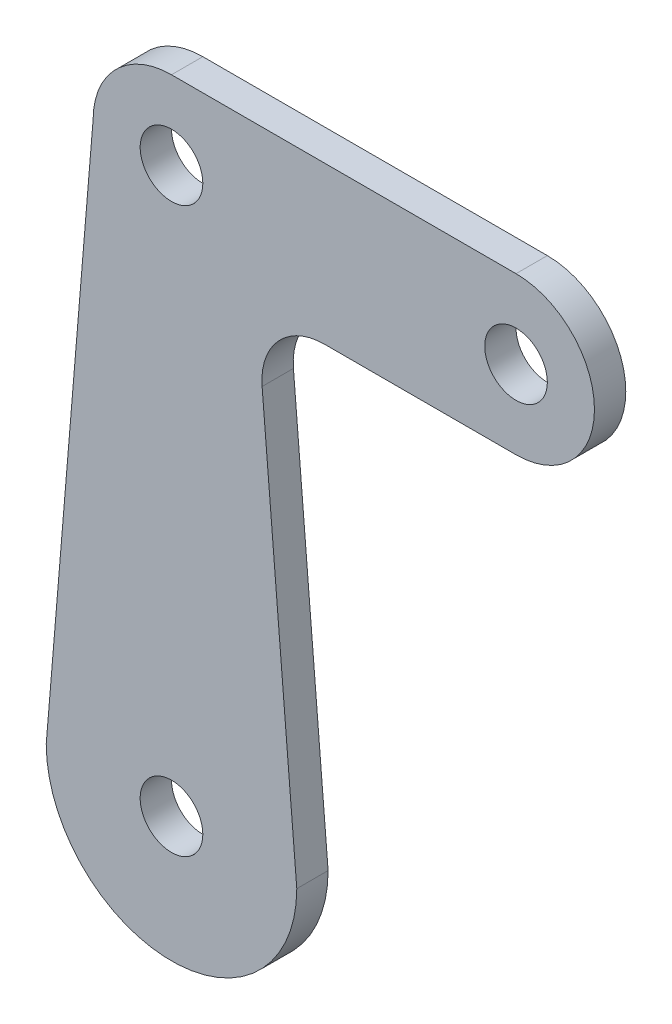
ISO-10303-21;
HEADER;
FILE_DESCRIPTION(('STEP AP214'),'2;1');
FILE_NAME('part.step','',(''),(''),'','','');
FILE_SCHEMA(('AUTOMOTIVE_DESIGN { 1 0 10303 214 1 1 1 1 }'));
ENDSEC;
DATA;
#1=APPLICATION_CONTEXT('core data for automotive mechanical design processes');
#2=APPLICATION_PROTOCOL_DEFINITION('international standard','automotive_design',2000,#1);
#3=PRODUCT_CONTEXT('',#1,'mechanical');
#4=PRODUCT('Part','Part','',(#3));
#5=PRODUCT_RELATED_PRODUCT_CATEGORY('part','',(#4));
#6=PRODUCT_DEFINITION_FORMATION('','',#4);
#7=PRODUCT_DEFINITION_CONTEXT('part definition',#1,'design');
#8=PRODUCT_DEFINITION('design','',#6,#7);
#9=PRODUCT_DEFINITION_SHAPE('','',#8);
#10=(LENGTH_UNIT() NAMED_UNIT(*) SI_UNIT(.MILLI.,.METRE.));
#11=(NAMED_UNIT(*) PLANE_ANGLE_UNIT() SI_UNIT($,.RADIAN.));
#12=(NAMED_UNIT(*) SI_UNIT($,.STERADIAN.) SOLID_ANGLE_UNIT());
#13=UNCERTAINTY_MEASURE_WITH_UNIT(LENGTH_MEASURE(1.E-05),#10,'distance_accuracy_value','');
#14=(GEOMETRIC_REPRESENTATION_CONTEXT(3) GLOBAL_UNCERTAINTY_ASSIGNED_CONTEXT((#13)) GLOBAL_UNIT_ASSIGNED_CONTEXT((#10,
#11,#12)) REPRESENTATION_CONTEXT('',''));
#15=CARTESIAN_POINT('',(0.,0.,0.));
#16=DIRECTION('',(0.,0.,1.));
#17=DIRECTION('',(1.,0.,0.));
#18=AXIS2_PLACEMENT_3D('',#15,#16,#17);
#19=CARTESIAN_POINT('',(7.89769540033013,0.656109523037215,3.175));
#20=DIRECTION('',(0.996566943102778,0.0827908685471065,0.));
#21=DIRECTION('',(-0.0827908685471065,0.996566943102778,0.));
#22=AXIS2_PLACEMENT_3D('',#19,#20,#21);
#23=PLANE('',#22);
#24=DIRECTION('',(0.0827908685471065,-0.996566943102778,0.));
#25=VECTOR('',#24,1.);
#26=CARTESIAN_POINT('',(7.89769540033013,0.656109523037215,0.));
#27=LINE('',#26,#25);
#28=CARTESIAN_POINT('',(9.18388178931443,-14.8259220152741,0.));
#29=VERTEX_POINT('',#28);
#30=CARTESIAN_POINT('',(12.7,-57.15,0.));
#31=VERTEX_POINT('',#30);
#32=EDGE_CURVE('E153',#29,#31,#27,.T.);
#33=ORIENTED_EDGE('',*,*,#32,.F.);
#34=DIRECTION('',(0.,0.,-1.));
#35=VECTOR('',#34,1.);
#36=CARTESIAN_POINT('',(9.18388178931443,-14.8259220152741,3.175));
#37=LINE('',#36,#35);
#38=CARTESIAN_POINT('',(9.18388178931443,-14.8259220152741,3.175));
#39=VERTEX_POINT('',#38);
#40=EDGE_CURVE('E11',#39,#29,#37,.T.);
#41=ORIENTED_EDGE('',*,*,#40,.F.);
#42=DIRECTION('',(0.0827908685471065,-0.996566943102778,0.));
#43=VECTOR('',#42,1.);
#44=CARTESIAN_POINT('',(7.89769540033013,0.656109523037215,3.175));
#45=LINE('',#44,#43);
#46=CARTESIAN_POINT('',(12.7,-57.15,3.175));
#47=VERTEX_POINT('',#46);
#48=EDGE_CURVE('E233',#39,#47,#45,.T.);
#49=ORIENTED_EDGE('',*,*,#48,.T.);
#50=DIRECTION('',(0.,0.,-1.));
#51=VECTOR('',#50,1.);
#52=CARTESIAN_POINT('',(12.7,-57.15,3.175));
#53=LINE('',#52,#51);
#54=EDGE_CURVE('E87',#47,#31,#53,.T.);
#55=ORIENTED_EDGE('',*,*,#54,.T.);
#56=EDGE_LOOP('',(#33,#41,#49,#55));
#57=FACE_BOUND('',#56,.T.);
#58=ADVANCED_FACE('F36',(#57),#23,.T.);
#59=CARTESIAN_POINT('',(15.5120818780171,-14.3002,3.175));
#60=DIRECTION('',(0.,0.,-1.));
#61=DIRECTION('',(-1.,0.,0.));
#62=AXIS2_PLACEMENT_3D('',#59,#60,#61);
#63=CYLINDRICAL_SURFACE('',#62,6.35);
#64=CARTESIAN_POINT('',(15.5120818780171,-14.3002,0.));
#65=DIRECTION('',(0.,0.,1.));
#66=DIRECTION('',(1.,0.,0.));
#67=AXIS2_PLACEMENT_3D('',#64,#65,#66);
#68=CIRCLE('',#67,6.35);
#69=CARTESIAN_POINT('',(15.5120818780171,-7.9502,0.));
#70=VERTEX_POINT('',#69);
#71=EDGE_CURVE('E151',#29,#70,#68,.F.);
#72=ORIENTED_EDGE('',*,*,#71,.T.);
#73=DIRECTION('',(0.,0.,-1.));
#74=VECTOR('',#73,1.);
#75=CARTESIAN_POINT('',(15.5120818780171,-7.9502,3.175));
#76=LINE('',#75,#74);
#77=CARTESIAN_POINT('',(15.5120818780171,-7.9502,3.175));
#78=VERTEX_POINT('',#77);
#79=EDGE_CURVE('E45',#78,#70,#76,.T.);
#80=ORIENTED_EDGE('',*,*,#79,.F.);
#81=CARTESIAN_POINT('',(15.5120818780171,-14.3002,3.175));
#82=DIRECTION('',(0.,0.,1.));
#83=DIRECTION('',(1.,0.,0.));
#84=AXIS2_PLACEMENT_3D('',#81,#82,#83);
#85=CIRCLE('',#84,6.35);
#86=EDGE_CURVE('E235',#39,#78,#85,.F.);
#87=ORIENTED_EDGE('',*,*,#86,.F.);
#88=ORIENTED_EDGE('',*,*,#40,.T.);
#89=EDGE_LOOP('',(#72,#80,#87,#88));
#90=FACE_BOUND('',#89,.T.);
#91=ADVANCED_FACE('F152',(#90),#63,.F.);
#92=CARTESIAN_POINT('',(0.,-7.95020000000001,3.175));
#93=DIRECTION('',(0.,1.,0.));
#94=DIRECTION('',(-1.,0.,0.));
#95=AXIS2_PLACEMENT_3D('',#92,#93,#94);
#96=PLANE('',#95);
#97=DIRECTION('',(1.,0.,0.));
#98=VECTOR('',#97,1.);
#99=CARTESIAN_POINT('',(0.,-7.95020000000001,0.));
#100=LINE('',#99,#98);
#101=CARTESIAN_POINT('',(34.925,-7.9502,0.));
#102=VERTEX_POINT('',#101);
#103=EDGE_CURVE('E145',#70,#102,#100,.T.);
#104=ORIENTED_EDGE('',*,*,#103,.T.);
#105=DIRECTION('',(0.,0.,-1.));
#106=VECTOR('',#105,1.);
#107=CARTESIAN_POINT('',(34.925,-7.9502,3.175));
#108=LINE('',#107,#106);
#109=CARTESIAN_POINT('',(34.925,-7.9502,3.175));
#110=VERTEX_POINT('',#109);
#111=EDGE_CURVE('E136',#110,#102,#108,.T.);
#112=ORIENTED_EDGE('',*,*,#111,.F.);
#113=DIRECTION('',(1.,0.,0.));
#114=VECTOR('',#113,1.);
#115=CARTESIAN_POINT('',(0.,-7.95020000000001,3.175));
#116=LINE('',#115,#114);
#117=EDGE_CURVE('E147',#78,#110,#116,.T.);
#118=ORIENTED_EDGE('',*,*,#117,.F.);
#119=ORIENTED_EDGE('',*,*,#79,.T.);
#120=EDGE_LOOP('',(#104,#112,#118,#119));
#121=FACE_BOUND('',#120,.T.);
#122=ADVANCED_FACE('F143',(#121),#96,.F.);
#123=CARTESIAN_POINT('',(34.925,0.,3.175));
#124=DIRECTION('',(0.,0.,-1.));
#125=DIRECTION('',(-1.,0.,0.));
#126=AXIS2_PLACEMENT_3D('',#123,#124,#125);
#127=CYLINDRICAL_SURFACE('',#126,7.9502);
#128=CARTESIAN_POINT('',(34.925,0.,0.));
#129=DIRECTION('',(0.,0.,1.));
#130=DIRECTION('',(1.,0.,0.));
#131=AXIS2_PLACEMENT_3D('',#128,#129,#130);
#132=CIRCLE('',#131,7.9502);
#133=CARTESIAN_POINT('',(34.925,7.9502,0.));
#134=VERTEX_POINT('',#133);
#135=EDGE_CURVE('E155',#102,#134,#132,.T.);
#136=ORIENTED_EDGE('',*,*,#135,.T.);
#137=DIRECTION('',(0.,0.,-1.));
#138=VECTOR('',#137,1.);
#139=CARTESIAN_POINT('',(34.925,7.9502,3.175));
#140=LINE('',#139,#138);
#141=CARTESIAN_POINT('',(34.925,7.9502,3.175));
#142=VERTEX_POINT('',#141);
#143=EDGE_CURVE('E129',#142,#134,#140,.T.);
#144=ORIENTED_EDGE('',*,*,#143,.F.);
#145=CARTESIAN_POINT('',(34.925,0.,3.175));
#146=DIRECTION('',(0.,0.,1.));
#147=DIRECTION('',(1.,0.,0.));
#148=AXIS2_PLACEMENT_3D('',#145,#146,#147);
#149=CIRCLE('',#148,7.9502);
#150=EDGE_CURVE('E242',#110,#142,#149,.T.);
#151=ORIENTED_EDGE('',*,*,#150,.F.);
#152=ORIENTED_EDGE('',*,*,#111,.T.);
#153=EDGE_LOOP('',(#136,#144,#151,#152));
#154=FACE_BOUND('',#153,.T.);
#155=ADVANCED_FACE('F203',(#154),#127,.T.);
#156=CARTESIAN_POINT('',(0.,7.9502,3.175));
#157=DIRECTION('',(0.,-1.,0.));
#158=DIRECTION('',(1.,0.,0.));
#159=AXIS2_PLACEMENT_3D('',#156,#157,#158);
#160=PLANE('',#159);
#161=DIRECTION('',(-1.,0.,0.));
#162=VECTOR('',#161,1.);
#163=CARTESIAN_POINT('',(0.,7.9502,0.));
#164=LINE('',#163,#162);
#165=CARTESIAN_POINT('',(0.,7.9502,0.));
#166=VERTEX_POINT('',#165);
#167=EDGE_CURVE('E163',#134,#166,#164,.T.);
#168=ORIENTED_EDGE('',*,*,#167,.T.);
#169=DIRECTION('',(0.,0.,-1.));
#170=VECTOR('',#169,1.);
#171=CARTESIAN_POINT('',(0.,7.9502,3.175));
#172=LINE('',#171,#170);
#173=CARTESIAN_POINT('',(0.,7.9502,3.175));
#174=VERTEX_POINT('',#173);
#175=EDGE_CURVE('E127',#174,#166,#172,.T.);
#176=ORIENTED_EDGE('',*,*,#175,.F.);
#177=DIRECTION('',(-1.,0.,0.));
#178=VECTOR('',#177,1.);
#179=CARTESIAN_POINT('',(0.,7.9502,3.175));
#180=LINE('',#179,#178);
#181=EDGE_CURVE('E120',#142,#174,#180,.T.);
#182=ORIENTED_EDGE('',*,*,#181,.F.);
#183=ORIENTED_EDGE('',*,*,#143,.T.);
#184=EDGE_LOOP('',(#168,#176,#182,#183));
#185=FACE_BOUND('',#184,.T.);
#186=ADVANCED_FACE('F206',(#185),#160,.F.);
#187=CARTESIAN_POINT('',(0.,0.,3.175));
#188=DIRECTION('',(0.,0.,-1.));
#189=DIRECTION('',(-1.,0.,0.));
#190=AXIS2_PLACEMENT_3D('',#187,#188,#189);
#191=CYLINDRICAL_SURFACE('',#190,7.9502);
#192=CARTESIAN_POINT('',(0.,0.,0.));
#193=DIRECTION('',(0.,0.,1.));
#194=DIRECTION('',(1.,0.,0.));
#195=AXIS2_PLACEMENT_3D('',#192,#193,#194);
#196=CIRCLE('',#195,7.9502);
#197=CARTESIAN_POINT('',(-7.9502,0.,0.));
#198=VERTEX_POINT('',#197);
#199=EDGE_CURVE('E126',#166,#198,#196,.T.);
#200=ORIENTED_EDGE('',*,*,#199,.T.);
#201=DIRECTION('',(0.,0.,-1.));
#202=VECTOR('',#201,1.);
#203=CARTESIAN_POINT('',(-7.9502,0.,3.175));
#204=LINE('',#203,#202);
#205=CARTESIAN_POINT('',(-7.9502,0.,3.175));
#206=VERTEX_POINT('',#205);
#207=EDGE_CURVE('E112',#206,#198,#204,.T.);
#208=ORIENTED_EDGE('',*,*,#207,.F.);
#209=CARTESIAN_POINT('',(0.,0.,3.175));
#210=DIRECTION('',(0.,0.,1.));
#211=DIRECTION('',(1.,0.,0.));
#212=AXIS2_PLACEMENT_3D('',#209,#210,#211);
#213=CIRCLE('',#212,7.9502);
#214=EDGE_CURVE('E115',#174,#206,#213,.T.);
#215=ORIENTED_EDGE('',*,*,#214,.F.);
#216=ORIENTED_EDGE('',*,*,#175,.T.);
#217=EDGE_LOOP('',(#200,#208,#215,#216));
#218=FACE_BOUND('',#217,.T.);
#219=ADVANCED_FACE('F125',(#218),#191,.T.);
#220=CARTESIAN_POINT('',(-7.89566106238213,0.656217163851315,3.175));
#221=DIRECTION('',(0.996564061591069,-0.0828255464522355,0.));
#222=DIRECTION('',(0.0828255464522355,0.996564061591069,0.));
#223=AXIS2_PLACEMENT_3D('',#220,#221,#222);
#224=PLANE('',#223);
#225=DIRECTION('',(-0.0828255464522355,-0.996564061591069,0.));
#226=VECTOR('',#225,1.);
#227=CARTESIAN_POINT('',(-7.89566106238213,0.656217163851315,0.));
#228=LINE('',#227,#226);
#229=CARTESIAN_POINT('',(-12.7,-57.15,0.));
#230=VERTEX_POINT('',#229);
#231=EDGE_CURVE('E167',#198,#230,#228,.T.);
#232=ORIENTED_EDGE('',*,*,#231,.T.);
#233=DIRECTION('',(0.,0.,-1.));
#234=VECTOR('',#233,1.);
#235=CARTESIAN_POINT('',(-12.7,-57.15,3.175));
#236=LINE('',#235,#234);
#237=CARTESIAN_POINT('',(-12.7,-57.15,3.175));
#238=VERTEX_POINT('',#237);
#239=EDGE_CURVE('E114',#238,#230,#236,.T.);
#240=ORIENTED_EDGE('',*,*,#239,.F.);
#241=DIRECTION('',(-0.0828255464522355,-0.996564061591069,0.));
#242=VECTOR('',#241,1.);
#243=CARTESIAN_POINT('',(-7.89566106238213,0.656217163851315,3.175));
#244=LINE('',#243,#242);
#245=EDGE_CURVE('E107',#206,#238,#244,.T.);
#246=ORIENTED_EDGE('',*,*,#245,.F.);
#247=ORIENTED_EDGE('',*,*,#207,.T.);
#248=EDGE_LOOP('',(#232,#240,#246,#247));
#249=FACE_BOUND('',#248,.T.);
#250=ADVANCED_FACE('F110',(#249),#224,.F.);
#251=CARTESIAN_POINT('',(0.,-57.15,3.175));
#252=DIRECTION('',(0.,0.,-1.));
#253=DIRECTION('',(-1.,0.,0.));
#254=AXIS2_PLACEMENT_3D('',#251,#252,#253);
#255=CYLINDRICAL_SURFACE('',#254,3.175);
#256=CARTESIAN_POINT('',(0.,-57.15,3.175));
#257=DIRECTION('',(0.,0.,1.));
#258=DIRECTION('',(1.,0.,0.));
#259=AXIS2_PLACEMENT_3D('',#256,#257,#258);
#260=CIRCLE('',#259,3.175);
#261=CARTESIAN_POINT('',(3.175,-57.15,3.175));
#262=VERTEX_POINT('',#261);
#263=EDGE_CURVE('E232',#262,#262,#260,.T.);
#264=ORIENTED_EDGE('',*,*,#263,.T.);
#265=EDGE_LOOP('',(#264));
#266=FACE_BOUND('',#265,.T.);
#267=CARTESIAN_POINT('',(0.,-57.15,0.));
#268=DIRECTION('',(0.,0.,1.));
#269=DIRECTION('',(1.,0.,0.));
#270=AXIS2_PLACEMENT_3D('',#267,#268,#269);
#271=CIRCLE('',#270,3.175);
#272=CARTESIAN_POINT('',(3.175,-57.15,0.));
#273=VERTEX_POINT('',#272);
#274=EDGE_CURVE('E157',#273,#273,#271,.T.);
#275=ORIENTED_EDGE('',*,*,#274,.F.);
#276=EDGE_LOOP('',(#275));
#277=FACE_BOUND('',#276,.T.);
#278=ADVANCED_FACE('F182',(#266,#277),#255,.F.);
#279=CARTESIAN_POINT('',(34.925,0.,3.175));
#280=DIRECTION('',(0.,0.,-1.));
#281=DIRECTION('',(-1.,0.,0.));
#282=AXIS2_PLACEMENT_3D('',#279,#280,#281);
#283=CYLINDRICAL_SURFACE('',#282,3.17500000000001);
#284=CARTESIAN_POINT('',(34.925,0.,3.175));
#285=DIRECTION('',(0.,0.,1.));
#286=DIRECTION('',(1.,0.,0.));
#287=AXIS2_PLACEMENT_3D('',#284,#285,#286);
#288=CIRCLE('',#287,3.17500000000001);
#289=CARTESIAN_POINT('',(38.1,0.,3.175));
#290=VERTEX_POINT('',#289);
#291=EDGE_CURVE('E230',#290,#290,#288,.T.);
#292=ORIENTED_EDGE('',*,*,#291,.T.);
#293=EDGE_LOOP('',(#292));
#294=FACE_BOUND('',#293,.T.);
#295=CARTESIAN_POINT('',(34.925,0.,0.));
#296=DIRECTION('',(0.,0.,1.));
#297=DIRECTION('',(1.,0.,0.));
#298=AXIS2_PLACEMENT_3D('',#295,#296,#297);
#299=CIRCLE('',#298,3.17500000000001);
#300=CARTESIAN_POINT('',(38.1,0.,0.));
#301=VERTEX_POINT('',#300);
#302=EDGE_CURVE('E175',#301,#301,#299,.T.);
#303=ORIENTED_EDGE('',*,*,#302,.F.);
#304=EDGE_LOOP('',(#303));
#305=FACE_BOUND('',#304,.T.);
#306=ADVANCED_FACE('F184',(#294,#305),#283,.F.);
#307=CARTESIAN_POINT('',(0.,0.,3.175));
#308=DIRECTION('',(0.,0.,-1.));
#309=DIRECTION('',(-1.,0.,0.));
#310=AXIS2_PLACEMENT_3D('',#307,#308,#309);
#311=CYLINDRICAL_SURFACE('',#310,3.175);
#312=CARTESIAN_POINT('',(0.,0.,3.175));
#313=DIRECTION('',(0.,0.,1.));
#314=DIRECTION('',(1.,0.,0.));
#315=AXIS2_PLACEMENT_3D('',#312,#313,#314);
#316=CIRCLE('',#315,3.175);
#317=CARTESIAN_POINT('',(3.175,0.,3.175));
#318=VERTEX_POINT('',#317);
#319=EDGE_CURVE('E169',#318,#318,#316,.T.);
#320=ORIENTED_EDGE('',*,*,#319,.T.);
#321=EDGE_LOOP('',(#320));
#322=FACE_BOUND('',#321,.T.);
#323=CARTESIAN_POINT('',(0.,0.,0.));
#324=DIRECTION('',(0.,0.,1.));
#325=DIRECTION('',(1.,0.,0.));
#326=AXIS2_PLACEMENT_3D('',#323,#324,#325);
#327=CIRCLE('',#326,3.175);
#328=CARTESIAN_POINT('',(3.175,0.,0.));
#329=VERTEX_POINT('',#328);
#330=EDGE_CURVE('E172',#329,#329,#327,.T.);
#331=ORIENTED_EDGE('',*,*,#330,.F.);
#332=EDGE_LOOP('',(#331));
#333=FACE_BOUND('',#332,.T.);
#334=ADVANCED_FACE('F38',(#322,#333),#311,.F.);
#335=CARTESIAN_POINT('',(0.,-57.15,3.175));
#336=DIRECTION('',(0.,0.,-1.));
#337=DIRECTION('',(-1.,0.,0.));
#338=AXIS2_PLACEMENT_3D('',#335,#336,#337);
#339=CYLINDRICAL_SURFACE('',#338,12.7);
#340=CARTESIAN_POINT('',(0.,-57.15,0.));
#341=DIRECTION('',(0.,0.,1.));
#342=DIRECTION('',(1.,0.,0.));
#343=AXIS2_PLACEMENT_3D('',#340,#341,#342);
#344=CIRCLE('',#343,12.7);
#345=EDGE_CURVE('E80',#230,#31,#344,.T.);
#346=ORIENTED_EDGE('',*,*,#345,.T.);
#347=ORIENTED_EDGE('',*,*,#54,.F.);
#348=CARTESIAN_POINT('',(0.,-57.15,3.175));
#349=DIRECTION('',(0.,0.,1.));
#350=DIRECTION('',(1.,0.,0.));
#351=AXIS2_PLACEMENT_3D('',#348,#349,#350);
#352=CIRCLE('',#351,12.7);
#353=EDGE_CURVE('E53',#238,#47,#352,.T.);
#354=ORIENTED_EDGE('',*,*,#353,.F.);
#355=ORIENTED_EDGE('',*,*,#239,.T.);
#356=EDGE_LOOP('',(#346,#347,#354,#355));
#357=FACE_BOUND('',#356,.T.);
#358=ADVANCED_FACE('F213',(#357),#339,.T.);
#359=CARTESIAN_POINT('',(0.,0.,3.175));
#360=DIRECTION('',(0.,0.,1.));
#361=DIRECTION('',(1.,0.,0.));
#362=AXIS2_PLACEMENT_3D('',#359,#360,#361);
#363=PLANE('',#362);
#364=ORIENTED_EDGE('',*,*,#319,.F.);
#365=EDGE_LOOP('',(#364));
#366=FACE_BOUND('',#365,.T.);
#367=ORIENTED_EDGE('',*,*,#291,.F.);
#368=EDGE_LOOP('',(#367));
#369=FACE_BOUND('',#368,.T.);
#370=ORIENTED_EDGE('',*,*,#263,.F.);
#371=EDGE_LOOP('',(#370));
#372=FACE_BOUND('',#371,.T.);
#373=ORIENTED_EDGE('',*,*,#48,.F.);
#374=ORIENTED_EDGE('',*,*,#86,.T.);
#375=ORIENTED_EDGE('',*,*,#117,.T.);
#376=ORIENTED_EDGE('',*,*,#150,.T.);
#377=ORIENTED_EDGE('',*,*,#181,.T.);
#378=ORIENTED_EDGE('',*,*,#214,.T.);
#379=ORIENTED_EDGE('',*,*,#245,.T.);
#380=ORIENTED_EDGE('',*,*,#353,.T.);
#381=EDGE_LOOP('',(#373,#374,#375,#376,#377,#378,#379,#380));
#382=FACE_BOUND('',#381,.T.);
#383=ADVANCED_FACE('F118',(#366,#369,#372,#382),#363,.T.);
#384=CARTESIAN_POINT('',(0.,0.,0.));
#385=DIRECTION('',(0.,0.,1.));
#386=DIRECTION('',(1.,0.,0.));
#387=AXIS2_PLACEMENT_3D('',#384,#385,#386);
#388=PLANE('',#387);
#389=ORIENTED_EDGE('',*,*,#330,.T.);
#390=EDGE_LOOP('',(#389));
#391=FACE_BOUND('',#390,.T.);
#392=ORIENTED_EDGE('',*,*,#302,.T.);
#393=EDGE_LOOP('',(#392));
#394=FACE_BOUND('',#393,.T.);
#395=ORIENTED_EDGE('',*,*,#274,.T.);
#396=EDGE_LOOP('',(#395));
#397=FACE_BOUND('',#396,.T.);
#398=ORIENTED_EDGE('',*,*,#32,.T.);
#399=ORIENTED_EDGE('',*,*,#345,.F.);
#400=ORIENTED_EDGE('',*,*,#231,.F.);
#401=ORIENTED_EDGE('',*,*,#199,.F.);
#402=ORIENTED_EDGE('',*,*,#167,.F.);
#403=ORIENTED_EDGE('',*,*,#135,.F.);
#404=ORIENTED_EDGE('',*,*,#103,.F.);
#405=ORIENTED_EDGE('',*,*,#71,.F.);
#406=EDGE_LOOP('',(#398,#399,#400,#401,#402,#403,#404,#405));
#407=FACE_BOUND('',#406,.T.);
#408=ADVANCED_FACE('F180',(#391,#394,#397,#407),#388,.F.);
#409=CLOSED_SHELL('',(#58,#91,#122,#155,#186,#219,#250,#278,#306,#334,#358,#383,#408));
#410=MANIFOLD_SOLID_BREP('B2',#409);
#411=ADVANCED_BREP_SHAPE_REPRESENTATION('',(#18,#410),#14);
#412=SHAPE_DEFINITION_REPRESENTATION(#9,#411);
ENDSEC;
END-ISO-10303-21;
